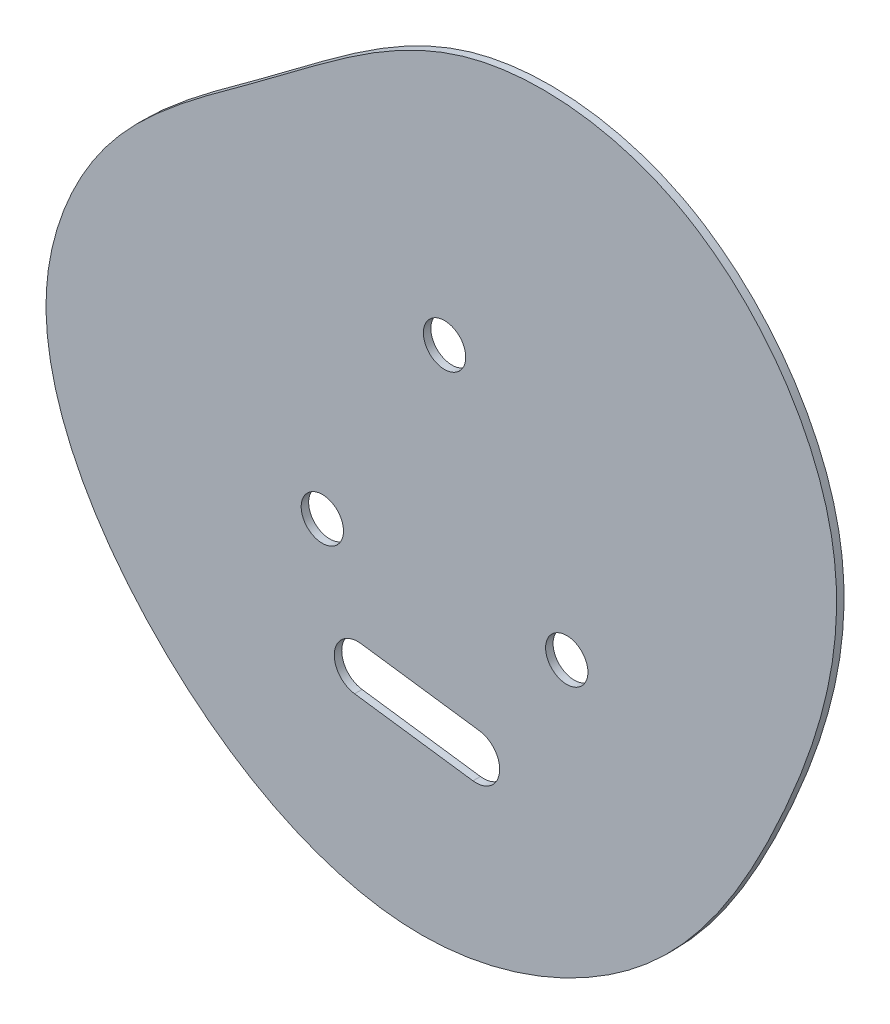
ISO-10303-21;
HEADER;
FILE_DESCRIPTION(('STEP AP214'),'2;1');
FILE_NAME('part.step','',(''),(''),'','','');
FILE_SCHEMA(('AUTOMOTIVE_DESIGN { 1 0 10303 214 1 1 1 1 }'));
ENDSEC;
DATA;
#1=APPLICATION_CONTEXT('core data for automotive mechanical design processes');
#2=APPLICATION_PROTOCOL_DEFINITION('international standard','automotive_design',2000,#1);
#3=PRODUCT_CONTEXT('',#1,'mechanical');
#4=PRODUCT('Part','Part','',(#3));
#5=PRODUCT_RELATED_PRODUCT_CATEGORY('part','',(#4));
#6=PRODUCT_DEFINITION_FORMATION('','',#4);
#7=PRODUCT_DEFINITION_CONTEXT('part definition',#1,'design');
#8=PRODUCT_DEFINITION('design','',#6,#7);
#9=PRODUCT_DEFINITION_SHAPE('','',#8);
#10=(LENGTH_UNIT() NAMED_UNIT(*) SI_UNIT(.MILLI.,.METRE.));
#11=(NAMED_UNIT(*) PLANE_ANGLE_UNIT() SI_UNIT($,.RADIAN.));
#12=(NAMED_UNIT(*) SI_UNIT($,.STERADIAN.) SOLID_ANGLE_UNIT());
#13=UNCERTAINTY_MEASURE_WITH_UNIT(LENGTH_MEASURE(1.E-05),#10,'distance_accuracy_value','');
#14=(GEOMETRIC_REPRESENTATION_CONTEXT(3) GLOBAL_UNCERTAINTY_ASSIGNED_CONTEXT((#13)) GLOBAL_UNIT_ASSIGNED_CONTEXT((#10,
#11,#12)) REPRESENTATION_CONTEXT('',''));
#15=CARTESIAN_POINT('',(0.,0.,0.));
#16=DIRECTION('',(0.,0.,1.));
#17=DIRECTION('',(1.,0.,0.));
#18=AXIS2_PLACEMENT_3D('',#15,#16,#17);
#19=CARTESIAN_POINT('',(-33.7591925316214,-51.0877572958972,0.396875));
#20=DIRECTION('',(0.,0.,-1.));
#21=DIRECTION('',(-1.,0.,0.));
#22=AXIS2_PLACEMENT_3D('',#19,#20,#21);
#23=PLANE('',#22);
#24=DIRECTION('',(0.990734013971996,-0.135816470131342,0.));
#25=VECTOR('',#24,1.);
#26=CARTESIAN_POINT('',(-22.1553572482574,-38.1563847863937,0.396875));
#27=LINE('',#26,#25);
#28=CARTESIAN_POINT('',(-22.1553572482574,-38.1563847863937,0.396875));
#29=VERTEX_POINT('',#28);
#30=CARTESIAN_POINT('',(-9.5730352708131,-39.8812539570617,0.396875));
#31=VERTEX_POINT('',#30);
#32=EDGE_CURVE('E84',#29,#31,#27,.T.);
#33=ORIENTED_EDGE('',*,*,#32,.F.);
#34=CARTESIAN_POINT('',(-21.8158160729291,-35.6795497514637,0.396875));
#35=DIRECTION('',(0.,0.,1.));
#36=DIRECTION('',(1.,0.,0.));
#37=AXIS2_PLACEMENT_3D('',#34,#35,#36);
#38=CIRCLE('',#37,2.5);
#39=CARTESIAN_POINT('',(-21.4762748976007,-33.2027147165337,0.396875));
#40=VERTEX_POINT('',#39);
#41=EDGE_CURVE('E40',#40,#29,#38,.T.);
#42=ORIENTED_EDGE('',*,*,#41,.F.);
#43=DIRECTION('',(-0.990734013971995,0.135816470131342,0.));
#44=VECTOR('',#43,1.);
#45=CARTESIAN_POINT('',(-21.4762748976007,-33.2027147165337,0.396875));
#46=LINE('',#45,#44);
#47=CARTESIAN_POINT('',(-8.89395292015639,-34.9275838872017,0.396875));
#48=VERTEX_POINT('',#47);
#49=EDGE_CURVE('E83',#48,#40,#46,.T.);
#50=ORIENTED_EDGE('',*,*,#49,.F.);
#51=CARTESIAN_POINT('',(-9.23349409548474,-37.4044189221317,0.396875));
#52=DIRECTION('',(0.,0.,1.));
#53=DIRECTION('',(1.,0.,0.));
#54=AXIS2_PLACEMENT_3D('',#51,#52,#53);
#55=CIRCLE('',#54,2.5);
#56=EDGE_CURVE('E73',#31,#48,#55,.T.);
#57=ORIENTED_EDGE('',*,*,#56,.F.);
#58=EDGE_LOOP('',(#33,#42,#50,#57));
#59=FACE_BOUND('',#58,.T.);
#60=CARTESIAN_POINT('',(-12.5939001772955,-1.27258597502269,0.396875));
#61=DIRECTION('',(0.,0.,1.));
#62=DIRECTION('',(1.,0.,0.));
#63=AXIS2_PLACEMENT_3D('',#60,#61,#62);
#64=CIRCLE('',#63,2.25);
#65=CARTESIAN_POINT('',(-10.3439001772955,-1.27258597502269,0.396875));
#66=VERTEX_POINT('',#65);
#67=EDGE_CURVE('E96',#66,#66,#64,.T.);
#68=ORIENTED_EDGE('',*,*,#67,.F.);
#69=EDGE_LOOP('',(#68));
#70=FACE_BOUND('',#69,.T.);
#71=CARTESIAN_POINT('',(-25.5842812340614,-23.7725859750231,0.396875));
#72=DIRECTION('',(0.,0.,1.));
#73=DIRECTION('',(1.,0.,0.));
#74=AXIS2_PLACEMENT_3D('',#71,#72,#73);
#75=CIRCLE('',#74,2.25);
#76=CARTESIAN_POINT('',(-23.3342812340614,-23.7725859750231,0.396875));
#77=VERTEX_POINT('',#76);
#78=EDGE_CURVE('E115',#77,#77,#75,.T.);
#79=ORIENTED_EDGE('',*,*,#78,.F.);
#80=EDGE_LOOP('',(#79));
#81=FACE_BOUND('',#80,.T.);
#82=CARTESIAN_POINT('',(11.9386620524207,24.1185465457295,0.396875));
#83=CARTESIAN_POINT('',(5.20364440677925,27.6120992019078,0.396875));
#84=CARTESIAN_POINT('',(-12.2470174353586,29.2167614094966,0.396875));
#85=CARTESIAN_POINT('',(-30.8394974353756,13.6101851488787,0.396875));
#86=CARTESIAN_POINT('',(-49.3034840199693,1.48863444913924,0.396875));
#87=CARTESIAN_POINT('',(-58.548601808476,-21.6644469486417,0.396875));
#88=CARTESIAN_POINT('',(-44.4112406156228,-46.5615027796323,0.396875));
#89=CARTESIAN_POINT('',(-17.2285118260004,-61.1448782543022,0.396875));
#90=CARTESIAN_POINT('',(10.6799256136422,-49.6929208569942,0.396875));
#91=CARTESIAN_POINT('',(24.5536983635309,-26.479665335045,0.396875));
#92=CARTESIAN_POINT('',(33.3871372918512,1.6837146830878,0.396875));
#93=CARTESIAN_POINT('',(20.4165403598043,19.7209464446097,0.396875));
#94=CARTESIAN_POINT('',(11.9386620524207,24.1185465457295,0.396875));
#95=B_SPLINE_CURVE_WITH_KNOTS('',3,(#82,#83,#84,#85,#86,#87,#88,#89,#90,#91,#92,#93,#94),
.UNSPECIFIED.,.T.,.F.,(4,1,1,1,1,1,1,1,1,1,4),(0.,0.0865126839490203,0.186061084877596,
0.274989579634364,0.344292201608353,0.456117157494113,0.576745765831715,0.675937243701793,
0.775538108496092,0.891099913147283,1.),.UNSPECIFIED.);
#96=CARTESIAN_POINT('',(11.9386620524207,24.1185465457295,0.396875));
#97=VERTEX_POINT('',#96);
#98=EDGE_CURVE('E11',#97,#97,#95,.T.);
#99=ORIENTED_EDGE('',*,*,#98,.T.);
#100=EDGE_LOOP('',(#99));
#101=FACE_BOUND('',#100,.T.);
#102=CARTESIAN_POINT('',(0.396480879471766,-23.7725859750223,0.396875));
#103=DIRECTION('',(0.,0.,1.));
#104=DIRECTION('',(1.,0.,0.));
#105=AXIS2_PLACEMENT_3D('',#102,#103,#104);
#106=CIRCLE('',#105,2.25);
#107=CARTESIAN_POINT('',(2.64648087947177,-23.7725859750223,0.396875));
#108=VERTEX_POINT('',#107);
#109=EDGE_CURVE('E121',#108,#108,#106,.T.);
#110=ORIENTED_EDGE('',*,*,#109,.F.);
#111=EDGE_LOOP('',(#110));
#112=FACE_BOUND('',#111,.T.);
#113=ADVANCED_FACE('F35',(#59,#70,#81,#101,#112),#23,.F.);
#114=CARTESIAN_POINT('',(-33.7591925316214,-51.0877572958972,-0.396875));
#115=DIRECTION('',(0.,0.,-1.));
#116=DIRECTION('',(-1.,0.,0.));
#117=AXIS2_PLACEMENT_3D('',#114,#115,#116);
#118=PLANE('',#117);
#119=CARTESIAN_POINT('',(-21.8158160729291,-35.6795497514637,-0.396875));
#120=DIRECTION('',(0.,0.,1.));
#121=DIRECTION('',(1.,0.,0.));
#122=AXIS2_PLACEMENT_3D('',#119,#120,#121);
#123=CIRCLE('',#122,2.5);
#124=CARTESIAN_POINT('',(-21.4762748976007,-33.2027147165337,-0.396875));
#125=VERTEX_POINT('',#124);
#126=CARTESIAN_POINT('',(-22.1553572482574,-38.1563847863937,-0.396875));
#127=VERTEX_POINT('',#126);
#128=EDGE_CURVE('E137',#125,#127,#123,.T.);
#129=ORIENTED_EDGE('',*,*,#128,.T.);
#130=DIRECTION('',(0.990734013971995,-0.135816470131342,0.));
#131=VECTOR('',#130,1.);
#132=CARTESIAN_POINT('',(-22.1553572482574,-38.1563847863937,-0.396875));
#133=LINE('',#132,#131);
#134=CARTESIAN_POINT('',(-9.57303527081309,-39.8812539570617,-0.396875));
#135=VERTEX_POINT('',#134);
#136=EDGE_CURVE('E134',#127,#135,#133,.T.);
#137=ORIENTED_EDGE('',*,*,#136,.T.);
#138=CARTESIAN_POINT('',(-9.23349409548474,-37.4044189221317,-0.396875));
#139=DIRECTION('',(0.,0.,1.));
#140=DIRECTION('',(1.,0.,0.));
#141=AXIS2_PLACEMENT_3D('',#138,#139,#140);
#142=CIRCLE('',#141,2.5);
#143=CARTESIAN_POINT('',(-8.89395292015639,-34.9275838872017,-0.396875));
#144=VERTEX_POINT('',#143);
#145=EDGE_CURVE('E61',#135,#144,#142,.T.);
#146=ORIENTED_EDGE('',*,*,#145,.T.);
#147=DIRECTION('',(-0.990734013971995,0.135816470131342,0.));
#148=VECTOR('',#147,1.);
#149=CARTESIAN_POINT('',(-21.4762748976007,-33.2027147165337,-0.396875));
#150=LINE('',#149,#148);
#151=EDGE_CURVE('E91',#144,#125,#150,.T.);
#152=ORIENTED_EDGE('',*,*,#151,.T.);
#153=EDGE_LOOP('',(#129,#137,#146,#152));
#154=FACE_BOUND('',#153,.T.);
#155=CARTESIAN_POINT('',(-12.5939001772955,-1.27258597502269,-0.396875));
#156=DIRECTION('',(0.,0.,1.));
#157=DIRECTION('',(1.,0.,0.));
#158=AXIS2_PLACEMENT_3D('',#155,#156,#157);
#159=CIRCLE('',#158,2.25);
#160=CARTESIAN_POINT('',(-10.3439001772955,-1.27258597502269,-0.396875));
#161=VERTEX_POINT('',#160);
#162=EDGE_CURVE('E124',#161,#161,#159,.T.);
#163=ORIENTED_EDGE('',*,*,#162,.T.);
#164=EDGE_LOOP('',(#163));
#165=FACE_BOUND('',#164,.T.);
#166=CARTESIAN_POINT('',(0.396480879471766,-23.7725859750223,-0.396875));
#167=DIRECTION('',(0.,0.,1.));
#168=DIRECTION('',(1.,0.,0.));
#169=AXIS2_PLACEMENT_3D('',#166,#167,#168);
#170=CIRCLE('',#169,2.25);
#171=CARTESIAN_POINT('',(2.64648087947177,-23.7725859750223,-0.396875));
#172=VERTEX_POINT('',#171);
#173=EDGE_CURVE('E118',#172,#172,#170,.T.);
#174=ORIENTED_EDGE('',*,*,#173,.T.);
#175=EDGE_LOOP('',(#174));
#176=FACE_BOUND('',#175,.T.);
#177=CARTESIAN_POINT('',(11.9386620524207,24.1185465457295,-0.396875));
#178=CARTESIAN_POINT('',(5.20364440677925,27.6120992019078,-0.396875));
#179=CARTESIAN_POINT('',(-12.2470174353586,29.2167614094966,-0.396875));
#180=CARTESIAN_POINT('',(-30.8394974353756,13.6101851488787,-0.396875));
#181=CARTESIAN_POINT('',(-49.3034840199693,1.48863444913924,-0.396875));
#182=CARTESIAN_POINT('',(-58.548601808476,-21.6644469486417,-0.396875));
#183=CARTESIAN_POINT('',(-44.4112406156228,-46.5615027796323,-0.396875));
#184=CARTESIAN_POINT('',(-17.2285118260004,-61.1448782543022,-0.396875));
#185=CARTESIAN_POINT('',(10.6799256136422,-49.6929208569942,-0.396875));
#186=CARTESIAN_POINT('',(24.5536983635309,-26.479665335045,-0.396875));
#187=CARTESIAN_POINT('',(33.3871372918512,1.6837146830878,-0.396875));
#188=CARTESIAN_POINT('',(20.4165403598043,19.7209464446097,-0.396875));
#189=CARTESIAN_POINT('',(11.9386620524207,24.1185465457295,-0.396875));
#190=B_SPLINE_CURVE_WITH_KNOTS('',3,(#177,#178,#179,#180,#181,#182,#183,#184,#185,#186,#187,
#188,#189),.UNSPECIFIED.,.T.,.F.,(4,1,1,1,1,1,1,1,1,1,4),(0.,0.0865126839490203,
0.186061084877596,0.274989579634364,0.344292201608353,0.456117157494113,0.576745765831715,
0.675937243701793,0.775538108496092,0.891099913147283,1.),.UNSPECIFIED.);
#191=CARTESIAN_POINT('',(11.9386620524207,24.1185465457295,-0.396875));
#192=VERTEX_POINT('',#191);
#193=EDGE_CURVE('E45',#192,#192,#190,.T.);
#194=ORIENTED_EDGE('',*,*,#193,.F.);
#195=EDGE_LOOP('',(#194));
#196=FACE_BOUND('',#195,.T.);
#197=CARTESIAN_POINT('',(-25.5842812340614,-23.7725859750231,-0.396875));
#198=DIRECTION('',(0.,0.,1.));
#199=DIRECTION('',(1.,0.,0.));
#200=AXIS2_PLACEMENT_3D('',#197,#198,#199);
#201=CIRCLE('',#200,2.25);
#202=CARTESIAN_POINT('',(-23.3342812340614,-23.7725859750231,-0.396875));
#203=VERTEX_POINT('',#202);
#204=EDGE_CURVE('E102',#203,#203,#201,.T.);
#205=ORIENTED_EDGE('',*,*,#204,.T.);
#206=EDGE_LOOP('',(#205));
#207=FACE_BOUND('',#206,.T.);
#208=ADVANCED_FACE('F142',(#154,#165,#176,#196,#207),#118,.T.);
#209=DIRECTION('',(0.,0.,-1.));
#210=VECTOR('',#209,1.);
#211=SURFACE_OF_LINEAR_EXTRUSION('',#95,#210);
#212=ORIENTED_EDGE('',*,*,#98,.F.);
#213=EDGE_LOOP('',(#212));
#214=FACE_BOUND('',#213,.T.);
#215=ORIENTED_EDGE('',*,*,#193,.T.);
#216=EDGE_LOOP('',(#215));
#217=FACE_BOUND('',#216,.T.);
#218=ADVANCED_FACE('F37',(#214,#217),#211,.F.);
#219=CARTESIAN_POINT('',(-25.5842812340614,-23.7725859750231,0.396875));
#220=DIRECTION('',(0.,0.,1.));
#221=DIRECTION('',(1.,0.,0.));
#222=AXIS2_PLACEMENT_3D('',#219,#220,#221);
#223=CYLINDRICAL_SURFACE('',#222,2.25);
#224=ORIENTED_EDGE('',*,*,#204,.F.);
#225=EDGE_LOOP('',(#224));
#226=FACE_BOUND('',#225,.T.);
#227=ORIENTED_EDGE('',*,*,#78,.T.);
#228=EDGE_LOOP('',(#227));
#229=FACE_BOUND('',#228,.T.);
#230=ADVANCED_FACE('F161',(#226,#229),#223,.F.);
#231=CARTESIAN_POINT('',(0.396480879471766,-23.7725859750223,0.396875));
#232=DIRECTION('',(0.,0.,1.));
#233=DIRECTION('',(1.,0.,0.));
#234=AXIS2_PLACEMENT_3D('',#231,#232,#233);
#235=CYLINDRICAL_SURFACE('',#234,2.25);
#236=ORIENTED_EDGE('',*,*,#173,.F.);
#237=EDGE_LOOP('',(#236));
#238=FACE_BOUND('',#237,.T.);
#239=ORIENTED_EDGE('',*,*,#109,.T.);
#240=EDGE_LOOP('',(#239));
#241=FACE_BOUND('',#240,.T.);
#242=ADVANCED_FACE('F164',(#238,#241),#235,.F.);
#243=CARTESIAN_POINT('',(-12.5939001772955,-1.27258597502269,0.396875));
#244=DIRECTION('',(0.,0.,1.));
#245=DIRECTION('',(1.,0.,0.));
#246=AXIS2_PLACEMENT_3D('',#243,#244,#245);
#247=CYLINDRICAL_SURFACE('',#246,2.25);
#248=ORIENTED_EDGE('',*,*,#162,.F.);
#249=EDGE_LOOP('',(#248));
#250=FACE_BOUND('',#249,.T.);
#251=ORIENTED_EDGE('',*,*,#67,.T.);
#252=EDGE_LOOP('',(#251));
#253=FACE_BOUND('',#252,.T.);
#254=ADVANCED_FACE('F168',(#250,#253),#247,.F.);
#255=CARTESIAN_POINT('',(-21.8158160729291,-35.6795497514637,-0.396875));
#256=DIRECTION('',(0.,0.,1.));
#257=DIRECTION('',(1.,0.,0.));
#258=AXIS2_PLACEMENT_3D('',#255,#256,#257);
#259=CYLINDRICAL_SURFACE('',#258,2.5);
#260=DIRECTION('',(0.,0.,1.));
#261=VECTOR('',#260,1.);
#262=CARTESIAN_POINT('',(-22.1553572482574,-38.1563847863937,-0.396875));
#263=LINE('',#262,#261);
#264=EDGE_CURVE('E52',#127,#29,#263,.T.);
#265=ORIENTED_EDGE('',*,*,#264,.F.);
#266=ORIENTED_EDGE('',*,*,#128,.F.);
#267=DIRECTION('',(0.,0.,1.));
#268=VECTOR('',#267,1.);
#269=CARTESIAN_POINT('',(-21.4762748976007,-33.2027147165337,-0.396875));
#270=LINE('',#269,#268);
#271=EDGE_CURVE('E92',#125,#40,#270,.T.);
#272=ORIENTED_EDGE('',*,*,#271,.T.);
#273=ORIENTED_EDGE('',*,*,#41,.T.);
#274=EDGE_LOOP('',(#265,#266,#272,#273));
#275=FACE_BOUND('',#274,.T.);
#276=ADVANCED_FACE('F146',(#275),#259,.F.);
#277=CARTESIAN_POINT('',(-21.4762748976007,-33.2027147165337,-0.396875));
#278=DIRECTION('',(0.135816470131342,0.990734013971996,0.));
#279=DIRECTION('',(-0.990734013971995,0.135816470131342,0.));
#280=AXIS2_PLACEMENT_3D('',#277,#278,#279);
#281=PLANE('',#280);
#282=ORIENTED_EDGE('',*,*,#271,.F.);
#283=ORIENTED_EDGE('',*,*,#151,.F.);
#284=DIRECTION('',(0.,0.,1.));
#285=VECTOR('',#284,1.);
#286=CARTESIAN_POINT('',(-8.89395292015639,-34.9275838872017,-0.396875));
#287=LINE('',#286,#285);
#288=EDGE_CURVE('E77',#144,#48,#287,.T.);
#289=ORIENTED_EDGE('',*,*,#288,.T.);
#290=ORIENTED_EDGE('',*,*,#49,.T.);
#291=EDGE_LOOP('',(#282,#283,#289,#290));
#292=FACE_BOUND('',#291,.T.);
#293=ADVANCED_FACE('F88',(#292),#281,.F.);
#294=CARTESIAN_POINT('',(-9.23349409548474,-37.4044189221317,-0.396875));
#295=DIRECTION('',(0.,0.,1.));
#296=DIRECTION('',(1.,0.,0.));
#297=AXIS2_PLACEMENT_3D('',#294,#295,#296);
#298=CYLINDRICAL_SURFACE('',#297,2.5);
#299=ORIENTED_EDGE('',*,*,#288,.F.);
#300=ORIENTED_EDGE('',*,*,#145,.F.);
#301=DIRECTION('',(0.,0.,1.));
#302=VECTOR('',#301,1.);
#303=CARTESIAN_POINT('',(-9.5730352708131,-39.8812539570617,-0.396875));
#304=LINE('',#303,#302);
#305=EDGE_CURVE('E79',#135,#31,#304,.T.);
#306=ORIENTED_EDGE('',*,*,#305,.T.);
#307=ORIENTED_EDGE('',*,*,#56,.T.);
#308=EDGE_LOOP('',(#299,#300,#306,#307));
#309=FACE_BOUND('',#308,.T.);
#310=ADVANCED_FACE('F75',(#309),#298,.F.);
#311=CARTESIAN_POINT('',(-22.1553572482574,-38.1563847863937,-0.396875));
#312=DIRECTION('',(-0.135816470131342,-0.990734013971996,0.));
#313=DIRECTION('',(0.990734013971996,-0.135816470131342,0.));
#314=AXIS2_PLACEMENT_3D('',#311,#312,#313);
#315=PLANE('',#314);
#316=ORIENTED_EDGE('',*,*,#305,.F.);
#317=ORIENTED_EDGE('',*,*,#136,.F.);
#318=ORIENTED_EDGE('',*,*,#264,.T.);
#319=ORIENTED_EDGE('',*,*,#32,.T.);
#320=EDGE_LOOP('',(#316,#317,#318,#319));
#321=FACE_BOUND('',#320,.T.);
#322=ADVANCED_FACE('F147',(#321),#315,.F.);
#323=CLOSED_SHELL('',(#113,#208,#218,#230,#242,#254,#276,#293,#310,#322));
#324=MANIFOLD_SOLID_BREP('B2',#323);
#325=ADVANCED_BREP_SHAPE_REPRESENTATION('',(#18,#324),#14);
#326=SHAPE_DEFINITION_REPRESENTATION(#9,#325);
ENDSEC;
END-ISO-10303-21;
